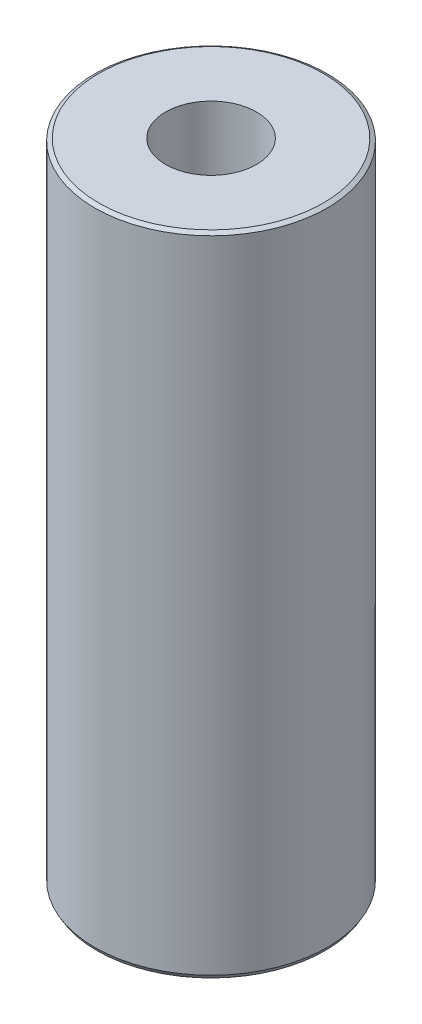
ISO-10303-21;
HEADER;
FILE_DESCRIPTION(('STEP AP214'),'2;1');
FILE_NAME('part.step','',(''),(''),'','','');
FILE_SCHEMA(('AUTOMOTIVE_DESIGN { 1 0 10303 214 1 1 1 1 }'));
ENDSEC;
DATA;
#1=APPLICATION_CONTEXT('core data for automotive mechanical design processes');
#2=APPLICATION_PROTOCOL_DEFINITION('international standard','automotive_design',2000,#1);
#3=PRODUCT_CONTEXT('',#1,'mechanical');
#4=PRODUCT('Part','Part','',(#3));
#5=PRODUCT_RELATED_PRODUCT_CATEGORY('part','',(#4));
#6=PRODUCT_DEFINITION_FORMATION('','',#4);
#7=PRODUCT_DEFINITION_CONTEXT('part definition',#1,'design');
#8=PRODUCT_DEFINITION('design','',#6,#7);
#9=PRODUCT_DEFINITION_SHAPE('','',#8);
#10=(LENGTH_UNIT() NAMED_UNIT(*) SI_UNIT(.MILLI.,.METRE.));
#11=(NAMED_UNIT(*) PLANE_ANGLE_UNIT() SI_UNIT($,.RADIAN.));
#12=(NAMED_UNIT(*) SI_UNIT($,.STERADIAN.) SOLID_ANGLE_UNIT());
#13=UNCERTAINTY_MEASURE_WITH_UNIT(LENGTH_MEASURE(1.E-05),#10,'distance_accuracy_value','');
#14=(GEOMETRIC_REPRESENTATION_CONTEXT(3) GLOBAL_UNCERTAINTY_ASSIGNED_CONTEXT((#13)) GLOBAL_UNIT_ASSIGNED_CONTEXT((#10,
#11,#12)) REPRESENTATION_CONTEXT('',''));
#15=CARTESIAN_POINT('',(0.,0.,0.));
#16=DIRECTION('',(0.,0.,1.));
#17=DIRECTION('',(1.,0.,0.));
#18=AXIS2_PLACEMENT_3D('',#15,#16,#17);
#19=CARTESIAN_POINT('',(0.,264.178328497659,0.));
#20=DIRECTION('',(0.,-1.,0.));
#21=DIRECTION('',(0.,0.,-1.));
#22=AXIS2_PLACEMENT_3D('',#19,#20,#21);
#23=CYLINDRICAL_SURFACE('',#22,47.5);
#24=CARTESIAN_POINT('',(0.,263.236252487422,0.));
#25=DIRECTION('',(0.,1.,0.));
#26=DIRECTION('',(0.,0.,1.));
#27=AXIS2_PLACEMENT_3D('',#24,#25,#26);
#28=CIRCLE('',#27,47.5);
#29=CARTESIAN_POINT('',(0.,263.236252487422,47.5));
#30=VERTEX_POINT('',#29);
#31=EDGE_CURVE('E50',#30,#30,#28,.F.);
#32=ORIENTED_EDGE('',*,*,#31,.T.);
#33=EDGE_LOOP('',(#32));
#34=FACE_BOUND('',#33,.T.);
#35=CARTESIAN_POINT('',(0.,1.63172351432239,0.));
#36=DIRECTION('',(0.,1.,0.));
#37=DIRECTION('',(0.,0.,1.));
#38=AXIS2_PLACEMENT_3D('',#35,#36,#37);
#39=CIRCLE('',#38,47.5);
#40=CARTESIAN_POINT('',(0.,1.63172351432239,47.5));
#41=VERTEX_POINT('',#40);
#42=EDGE_CURVE('E51',#41,#41,#39,.T.);
#43=ORIENTED_EDGE('',*,*,#42,.T.);
#44=EDGE_LOOP('',(#43));
#45=FACE_BOUND('',#44,.T.);
#46=ADVANCED_FACE('F39',(#34,#45),#23,.T.);
#47=CARTESIAN_POINT('',(0.,264.178328497659,0.));
#48=DIRECTION('',(0.,1.,0.));
#49=DIRECTION('',(0.,0.,1.));
#50=AXIS2_PLACEMENT_3D('',#47,#48,#49);
#51=PLANE('',#50);
#52=CARTESIAN_POINT('',(0.,264.178328497659,0.));
#53=DIRECTION('',(0.,1.,0.));
#54=DIRECTION('',(0.,0.,1.));
#55=AXIS2_PLACEMENT_3D('',#52,#53,#54);
#56=CIRCLE('',#55,45.8682764856775);
#57=CARTESIAN_POINT('',(0.,264.178328497659,45.8682764856775));
#58=VERTEX_POINT('',#57);
#59=EDGE_CURVE('E54',#58,#58,#56,.T.);
#60=ORIENTED_EDGE('',*,*,#59,.T.);
#61=EDGE_LOOP('',(#60));
#62=FACE_BOUND('',#61,.T.);
#63=CARTESIAN_POINT('',(0.,264.178328497659,0.));
#64=DIRECTION('',(0.,1.,0.));
#65=DIRECTION('',(0.,0.,1.));
#66=AXIS2_PLACEMENT_3D('',#63,#64,#65);
#67=CIRCLE('',#66,18.5950089180492);
#68=CARTESIAN_POINT('',(0.,264.178328497659,18.5950089180492));
#69=VERTEX_POINT('',#68);
#70=EDGE_CURVE('E58',#69,#69,#67,.T.);
#71=ORIENTED_EDGE('',*,*,#70,.F.);
#72=EDGE_LOOP('',(#71));
#73=FACE_BOUND('',#72,.T.);
#74=ADVANCED_FACE('F69',(#62,#73),#51,.T.);
#75=CARTESIAN_POINT('',(0.,0.,0.));
#76=DIRECTION('',(0.,1.,0.));
#77=DIRECTION('',(0.,0.,1.));
#78=AXIS2_PLACEMENT_3D('',#75,#76,#77);
#79=PLANE('',#78);
#80=CARTESIAN_POINT('',(0.,0.,0.));
#81=DIRECTION('',(0.,1.,0.));
#82=DIRECTION('',(0.,0.,1.));
#83=AXIS2_PLACEMENT_3D('',#80,#81,#82);
#84=CIRCLE('',#83,46.5579239897629);
#85=CARTESIAN_POINT('',(0.,0.,46.5579239897629));
#86=VERTEX_POINT('',#85);
#87=EDGE_CURVE('E10',#86,#86,#84,.F.);
#88=ORIENTED_EDGE('',*,*,#87,.T.);
#89=EDGE_LOOP('',(#88));
#90=FACE_BOUND('',#89,.T.);
#91=CARTESIAN_POINT('',(0.,0.,0.));
#92=DIRECTION('',(0.,1.,0.));
#93=DIRECTION('',(0.,0.,1.));
#94=AXIS2_PLACEMENT_3D('',#91,#92,#93);
#95=CIRCLE('',#94,18.5950089180492);
#96=CARTESIAN_POINT('',(0.,0.,18.5950089180492));
#97=VERTEX_POINT('',#96);
#98=EDGE_CURVE('E63',#97,#97,#95,.T.);
#99=ORIENTED_EDGE('',*,*,#98,.T.);
#100=EDGE_LOOP('',(#99));
#101=FACE_BOUND('',#100,.T.);
#102=ADVANCED_FACE('F75',(#90,#101),#79,.F.);
#103=CARTESIAN_POINT('',(0.,264.178328497659,0.));
#104=DIRECTION('',(0.,-1.,0.));
#105=DIRECTION('',(0.,0.,-1.));
#106=AXIS2_PLACEMENT_3D('',#103,#104,#105);
#107=CYLINDRICAL_SURFACE('',#106,18.5950089180492);
#108=ORIENTED_EDGE('',*,*,#70,.T.);
#109=EDGE_LOOP('',(#108));
#110=FACE_BOUND('',#109,.T.);
#111=ORIENTED_EDGE('',*,*,#98,.F.);
#112=EDGE_LOOP('',(#111));
#113=FACE_BOUND('',#112,.T.);
#114=ADVANCED_FACE('F70',(#110,#113),#107,.F.);
#115=CARTESIAN_POINT('',(0.,264.178328497659,0.));
#116=DIRECTION('',(0.,-1.,0.));
#117=DIRECTION('',(0.,0.,-1.));
#118=AXIS2_PLACEMENT_3D('',#115,#116,#117);
#119=CONICAL_SURFACE('',#118,45.8682764856775,1.04719755119661);
#120=ORIENTED_EDGE('',*,*,#31,.F.);
#121=EDGE_LOOP('',(#120));
#122=FACE_BOUND('',#121,.T.);
#123=ORIENTED_EDGE('',*,*,#59,.F.);
#124=EDGE_LOOP('',(#123));
#125=FACE_BOUND('',#124,.T.);
#126=ADVANCED_FACE('F81',(#122,#125),#119,.T.);
#127=CARTESIAN_POINT('',(0.,1.63172351432239,0.));
#128=DIRECTION('',(0.,1.,0.));
#129=DIRECTION('',(0.,0.,1.));
#130=AXIS2_PLACEMENT_3D('',#127,#128,#129);
#131=CONICAL_SURFACE('',#130,47.5,0.523598775598315);
#132=ORIENTED_EDGE('',*,*,#87,.F.);
#133=EDGE_LOOP('',(#132));
#134=FACE_BOUND('',#133,.T.);
#135=ORIENTED_EDGE('',*,*,#42,.F.);
#136=EDGE_LOOP('',(#135));
#137=FACE_BOUND('',#136,.T.);
#138=ADVANCED_FACE('F45',(#134,#137),#131,.T.);
#139=CLOSED_SHELL('',(#46,#74,#102,#114,#126,#138));
#140=MANIFOLD_SOLID_BREP('B2',#139);
#141=ADVANCED_BREP_SHAPE_REPRESENTATION('',(#18,#140),#14);
#142=SHAPE_DEFINITION_REPRESENTATION(#9,#141);
ENDSEC;
END-ISO-10303-21;
